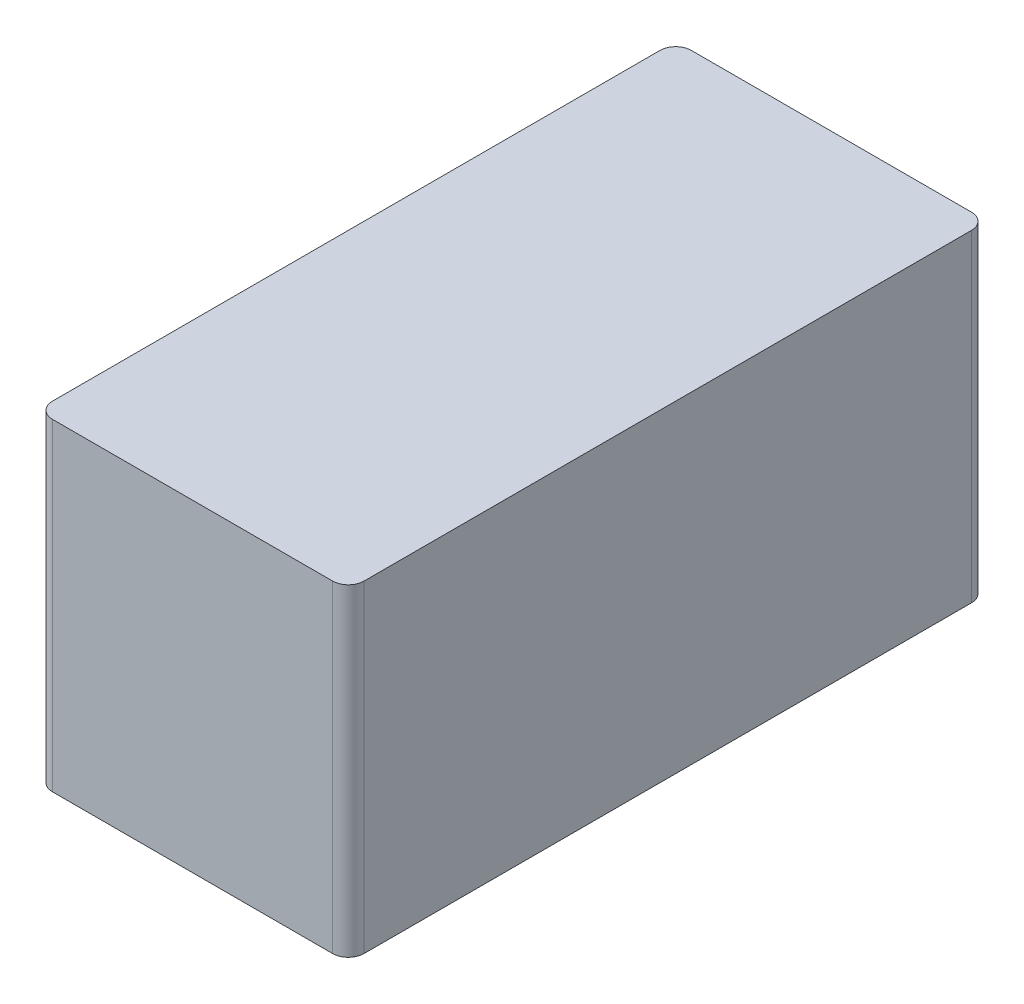
ISO-10303-21;
HEADER;
FILE_DESCRIPTION(('STEP AP214'),'2;1');
FILE_NAME('part.step','',(''),(''),'','','');
FILE_SCHEMA(('AUTOMOTIVE_DESIGN { 1 0 10303 214 1 1 1 1 }'));
ENDSEC;
DATA;
#1=APPLICATION_CONTEXT('core data for automotive mechanical design processes');
#2=APPLICATION_PROTOCOL_DEFINITION('international standard','automotive_design',2000,#1);
#3=PRODUCT_CONTEXT('',#1,'mechanical');
#4=PRODUCT('Part','Part','',(#3));
#5=PRODUCT_RELATED_PRODUCT_CATEGORY('part','',(#4));
#6=PRODUCT_DEFINITION_FORMATION('','',#4);
#7=PRODUCT_DEFINITION_CONTEXT('part definition',#1,'design');
#8=PRODUCT_DEFINITION('design','',#6,#7);
#9=PRODUCT_DEFINITION_SHAPE('','',#8);
#10=(LENGTH_UNIT() NAMED_UNIT(*) SI_UNIT(.MILLI.,.METRE.));
#11=(NAMED_UNIT(*) PLANE_ANGLE_UNIT() SI_UNIT($,.RADIAN.));
#12=(NAMED_UNIT(*) SI_UNIT($,.STERADIAN.) SOLID_ANGLE_UNIT());
#13=UNCERTAINTY_MEASURE_WITH_UNIT(LENGTH_MEASURE(1.E-05),#10,'distance_accuracy_value','');
#14=(GEOMETRIC_REPRESENTATION_CONTEXT(3) GLOBAL_UNCERTAINTY_ASSIGNED_CONTEXT((#13)) GLOBAL_UNIT_ASSIGNED_CONTEXT((#10,
#11,#12)) REPRESENTATION_CONTEXT('',''));
#15=CARTESIAN_POINT('',(0.,0.,0.));
#16=DIRECTION('',(0.,0.,1.));
#17=DIRECTION('',(1.,0.,0.));
#18=AXIS2_PLACEMENT_3D('',#15,#16,#17);
#19=CARTESIAN_POINT('',(9.9,10.25,-20.3));
#20=DIRECTION('',(-1.,0.,0.));
#21=DIRECTION('',(0.,0.,1.));
#22=AXIS2_PLACEMENT_3D('',#19,#20,#21);
#23=PLANE('',#22);
#24=DIRECTION('',(0.,0.,-1.));
#25=VECTOR('',#24,1.);
#26=CARTESIAN_POINT('',(9.9,-10.25,-20.3));
#27=LINE('',#26,#25);
#28=CARTESIAN_POINT('',(9.9,-10.25,19.3));
#29=VERTEX_POINT('',#28);
#30=CARTESIAN_POINT('',(9.9,-10.25,-19.3));
#31=VERTEX_POINT('',#30);
#32=EDGE_CURVE('E127',#29,#31,#27,.T.);
#33=ORIENTED_EDGE('',*,*,#32,.T.);
#34=DIRECTION('',(0.,-1.,0.));
#35=VECTOR('',#34,1.);
#36=CARTESIAN_POINT('',(9.9,10.25,-19.3));
#37=LINE('',#36,#35);
#38=CARTESIAN_POINT('',(9.9,10.25,-19.3));
#39=VERTEX_POINT('',#38);
#40=EDGE_CURVE('E150',#31,#39,#37,.F.);
#41=ORIENTED_EDGE('',*,*,#40,.T.);
#42=DIRECTION('',(0.,0.,-1.));
#43=VECTOR('',#42,1.);
#44=CARTESIAN_POINT('',(9.9,10.25,-20.3));
#45=LINE('',#44,#43);
#46=CARTESIAN_POINT('',(9.9,10.25,19.3));
#47=VERTEX_POINT('',#46);
#48=EDGE_CURVE('E125',#47,#39,#45,.T.);
#49=ORIENTED_EDGE('',*,*,#48,.F.);
#50=DIRECTION('',(0.,-1.,0.));
#51=VECTOR('',#50,1.);
#52=CARTESIAN_POINT('',(9.9,10.25,19.3));
#53=LINE('',#52,#51);
#54=EDGE_CURVE('E147',#47,#29,#53,.T.);
#55=ORIENTED_EDGE('',*,*,#54,.T.);
#56=EDGE_LOOP('',(#33,#41,#49,#55));
#57=FACE_BOUND('',#56,.T.);
#58=ADVANCED_FACE('F32',(#57),#23,.F.);
#59=CARTESIAN_POINT('',(-9.9,10.25,-20.3));
#60=DIRECTION('',(0.,0.,1.));
#61=DIRECTION('',(1.,0.,0.));
#62=AXIS2_PLACEMENT_3D('',#59,#60,#61);
#63=PLANE('',#62);
#64=DIRECTION('',(-1.,0.,0.));
#65=VECTOR('',#64,1.);
#66=CARTESIAN_POINT('',(-9.9,-10.25,-20.3));
#67=LINE('',#66,#65);
#68=CARTESIAN_POINT('',(8.9,-10.25,-20.3));
#69=VERTEX_POINT('',#68);
#70=CARTESIAN_POINT('',(-8.9,-10.25,-20.3));
#71=VERTEX_POINT('',#70);
#72=EDGE_CURVE('E123',#69,#71,#67,.T.);
#73=ORIENTED_EDGE('',*,*,#72,.T.);
#74=DIRECTION('',(0.,-1.,0.));
#75=VECTOR('',#74,1.);
#76=CARTESIAN_POINT('',(-8.9,10.25,-20.3));
#77=LINE('',#76,#75);
#78=CARTESIAN_POINT('',(-8.9,10.25,-20.3));
#79=VERTEX_POINT('',#78);
#80=EDGE_CURVE('E102',#71,#79,#77,.F.);
#81=ORIENTED_EDGE('',*,*,#80,.T.);
#82=DIRECTION('',(-1.,0.,0.));
#83=VECTOR('',#82,1.);
#84=CARTESIAN_POINT('',(-9.9,10.25,-20.3));
#85=LINE('',#84,#83);
#86=CARTESIAN_POINT('',(8.9,10.25,-20.3));
#87=VERTEX_POINT('',#86);
#88=EDGE_CURVE('E166',#87,#79,#85,.T.);
#89=ORIENTED_EDGE('',*,*,#88,.F.);
#90=DIRECTION('',(0.,-1.,0.));
#91=VECTOR('',#90,1.);
#92=CARTESIAN_POINT('',(8.9,10.25,-20.3));
#93=LINE('',#92,#91);
#94=EDGE_CURVE('E107',#87,#69,#93,.T.);
#95=ORIENTED_EDGE('',*,*,#94,.T.);
#96=EDGE_LOOP('',(#73,#81,#89,#95));
#97=FACE_BOUND('',#96,.T.);
#98=ADVANCED_FACE('F183',(#97),#63,.F.);
#99=CARTESIAN_POINT('',(-9.9,10.25,-20.3));
#100=DIRECTION('',(1.,0.,0.));
#101=DIRECTION('',(0.,0.,-1.));
#102=AXIS2_PLACEMENT_3D('',#99,#100,#101);
#103=PLANE('',#102);
#104=DIRECTION('',(0.,0.,1.));
#105=VECTOR('',#104,1.);
#106=CARTESIAN_POINT('',(-9.9,10.25,-20.3));
#107=LINE('',#106,#105);
#108=CARTESIAN_POINT('',(-9.9,10.25,-19.3));
#109=VERTEX_POINT('',#108);
#110=CARTESIAN_POINT('',(-9.9,10.25,19.3));
#111=VERTEX_POINT('',#110);
#112=EDGE_CURVE('E116',#109,#111,#107,.T.);
#113=ORIENTED_EDGE('',*,*,#112,.F.);
#114=DIRECTION('',(0.,-1.,0.));
#115=VECTOR('',#114,1.);
#116=CARTESIAN_POINT('',(-9.9,10.25,-19.3));
#117=LINE('',#116,#115);
#118=CARTESIAN_POINT('',(-9.9,-10.25,-19.3));
#119=VERTEX_POINT('',#118);
#120=EDGE_CURVE('E101',#109,#119,#117,.T.);
#121=ORIENTED_EDGE('',*,*,#120,.T.);
#122=DIRECTION('',(0.,0.,1.));
#123=VECTOR('',#122,1.);
#124=CARTESIAN_POINT('',(-9.9,-10.25,-20.3));
#125=LINE('',#124,#123);
#126=CARTESIAN_POINT('',(-9.9,-10.25,19.3));
#127=VERTEX_POINT('',#126);
#128=EDGE_CURVE('E114',#119,#127,#125,.T.);
#129=ORIENTED_EDGE('',*,*,#128,.T.);
#130=DIRECTION('',(0.,-1.,0.));
#131=VECTOR('',#130,1.);
#132=CARTESIAN_POINT('',(-9.9,10.25,19.3));
#133=LINE('',#132,#131);
#134=EDGE_CURVE('E118',#127,#111,#133,.F.);
#135=ORIENTED_EDGE('',*,*,#134,.T.);
#136=EDGE_LOOP('',(#113,#121,#129,#135));
#137=FACE_BOUND('',#136,.T.);
#138=ADVANCED_FACE('F113',(#137),#103,.F.);
#139=CARTESIAN_POINT('',(-9.9,10.25,20.3));
#140=DIRECTION('',(0.,0.,-1.));
#141=DIRECTION('',(-1.,0.,0.));
#142=AXIS2_PLACEMENT_3D('',#139,#140,#141);
#143=PLANE('',#142);
#144=DIRECTION('',(1.,0.,0.));
#145=VECTOR('',#144,1.);
#146=CARTESIAN_POINT('',(-9.9,-10.25,20.3));
#147=LINE('',#146,#145);
#148=CARTESIAN_POINT('',(-8.9,-10.25,20.3));
#149=VERTEX_POINT('',#148);
#150=CARTESIAN_POINT('',(8.90000000000001,-10.25,20.3));
#151=VERTEX_POINT('',#150);
#152=EDGE_CURVE('E122',#149,#151,#147,.T.);
#153=ORIENTED_EDGE('',*,*,#152,.T.);
#154=DIRECTION('',(0.,-1.,0.));
#155=VECTOR('',#154,1.);
#156=CARTESIAN_POINT('',(8.90000000000001,10.25,20.3));
#157=LINE('',#156,#155);
#158=CARTESIAN_POINT('',(8.90000000000001,10.25,20.3));
#159=VERTEX_POINT('',#158);
#160=EDGE_CURVE('E11',#151,#159,#157,.F.);
#161=ORIENTED_EDGE('',*,*,#160,.T.);
#162=DIRECTION('',(1.,0.,0.));
#163=VECTOR('',#162,1.);
#164=CARTESIAN_POINT('',(-9.9,10.25,20.3));
#165=LINE('',#164,#163);
#166=CARTESIAN_POINT('',(-8.9,10.25,20.3));
#167=VERTEX_POINT('',#166);
#168=EDGE_CURVE('E131',#167,#159,#165,.T.);
#169=ORIENTED_EDGE('',*,*,#168,.F.);
#170=DIRECTION('',(0.,-1.,0.));
#171=VECTOR('',#170,1.);
#172=CARTESIAN_POINT('',(-8.9,10.25,20.3));
#173=LINE('',#172,#171);
#174=EDGE_CURVE('E40',#167,#149,#173,.T.);
#175=ORIENTED_EDGE('',*,*,#174,.T.);
#176=EDGE_LOOP('',(#153,#161,#169,#175));
#177=FACE_BOUND('',#176,.T.);
#178=ADVANCED_FACE('F153',(#177),#143,.F.);
#179=CARTESIAN_POINT('',(0.,10.25,0.));
#180=DIRECTION('',(0.,1.,0.));
#181=DIRECTION('',(0.,0.,1.));
#182=AXIS2_PLACEMENT_3D('',#179,#180,#181);
#183=PLANE('',#182);
#184=ORIENTED_EDGE('',*,*,#88,.T.);
#185=CARTESIAN_POINT('',(-8.9,10.25,-19.3));
#186=DIRECTION('',(0.,1.,0.));
#187=DIRECTION('',(0.,0.,1.));
#188=AXIS2_PLACEMENT_3D('',#185,#186,#187);
#189=CIRCLE('',#188,1.);
#190=EDGE_CURVE('E145',#79,#109,#189,.T.);
#191=ORIENTED_EDGE('',*,*,#190,.T.);
#192=ORIENTED_EDGE('',*,*,#112,.T.);
#193=CARTESIAN_POINT('',(-8.9,10.25,19.3));
#194=DIRECTION('',(0.,1.,0.));
#195=DIRECTION('',(0.,0.,1.));
#196=AXIS2_PLACEMENT_3D('',#193,#194,#195);
#197=CIRCLE('',#196,1.);
#198=EDGE_CURVE('E52',#111,#167,#197,.T.);
#199=ORIENTED_EDGE('',*,*,#198,.T.);
#200=ORIENTED_EDGE('',*,*,#168,.T.);
#201=CARTESIAN_POINT('',(8.90000000000001,10.25,19.3));
#202=DIRECTION('',(0.,1.,0.));
#203=DIRECTION('',(0.,0.,1.));
#204=AXIS2_PLACEMENT_3D('',#201,#202,#203);
#205=CIRCLE('',#204,1.);
#206=EDGE_CURVE('E141',#159,#47,#205,.T.);
#207=ORIENTED_EDGE('',*,*,#206,.T.);
#208=ORIENTED_EDGE('',*,*,#48,.T.);
#209=CARTESIAN_POINT('',(8.9,10.25,-19.3));
#210=DIRECTION('',(0.,1.,0.));
#211=DIRECTION('',(0.,0.,1.));
#212=AXIS2_PLACEMENT_3D('',#209,#210,#211);
#213=CIRCLE('',#212,1.);
#214=EDGE_CURVE('E143',#39,#87,#213,.T.);
#215=ORIENTED_EDGE('',*,*,#214,.T.);
#216=EDGE_LOOP('',(#184,#191,#192,#199,#200,#207,#208,#215));
#217=FACE_BOUND('',#216,.T.);
#218=ADVANCED_FACE('F172',(#217),#183,.T.);
#219=CARTESIAN_POINT('',(0.,-10.25,0.));
#220=DIRECTION('',(0.,1.,0.));
#221=DIRECTION('',(0.,0.,1.));
#222=AXIS2_PLACEMENT_3D('',#219,#220,#221);
#223=PLANE('',#222);
#224=ORIENTED_EDGE('',*,*,#128,.F.);
#225=CARTESIAN_POINT('',(-8.9,-10.25,-19.3));
#226=DIRECTION('',(0.,1.,0.));
#227=DIRECTION('',(0.,0.,1.));
#228=AXIS2_PLACEMENT_3D('',#225,#226,#227);
#229=CIRCLE('',#228,1.);
#230=EDGE_CURVE('E97',#119,#71,#229,.F.);
#231=ORIENTED_EDGE('',*,*,#230,.T.);
#232=ORIENTED_EDGE('',*,*,#72,.F.);
#233=CARTESIAN_POINT('',(8.9,-10.25,-19.3));
#234=DIRECTION('',(0.,1.,0.));
#235=DIRECTION('',(0.,0.,1.));
#236=AXIS2_PLACEMENT_3D('',#233,#234,#235);
#237=CIRCLE('',#236,1.);
#238=EDGE_CURVE('E108',#69,#31,#237,.F.);
#239=ORIENTED_EDGE('',*,*,#238,.T.);
#240=ORIENTED_EDGE('',*,*,#32,.F.);
#241=CARTESIAN_POINT('',(8.90000000000001,-10.25,19.3));
#242=DIRECTION('',(0.,1.,0.));
#243=DIRECTION('',(0.,0.,1.));
#244=AXIS2_PLACEMENT_3D('',#241,#242,#243);
#245=CIRCLE('',#244,1.);
#246=EDGE_CURVE('E134',#29,#151,#245,.F.);
#247=ORIENTED_EDGE('',*,*,#246,.T.);
#248=ORIENTED_EDGE('',*,*,#152,.F.);
#249=CARTESIAN_POINT('',(-8.9,-10.25,19.3));
#250=DIRECTION('',(0.,1.,0.));
#251=DIRECTION('',(0.,0.,1.));
#252=AXIS2_PLACEMENT_3D('',#249,#250,#251);
#253=CIRCLE('',#252,1.);
#254=EDGE_CURVE('E117',#149,#127,#253,.F.);
#255=ORIENTED_EDGE('',*,*,#254,.T.);
#256=EDGE_LOOP('',(#224,#231,#232,#239,#240,#247,#248,#255));
#257=FACE_BOUND('',#256,.T.);
#258=ADVANCED_FACE('F120',(#257),#223,.F.);
#259=CARTESIAN_POINT('',(-8.9,10.25,-19.3));
#260=DIRECTION('',(0.,-1.,0.));
#261=DIRECTION('',(0.,0.,-1.));
#262=AXIS2_PLACEMENT_3D('',#259,#260,#261);
#263=CYLINDRICAL_SURFACE('',#262,1.);
#264=ORIENTED_EDGE('',*,*,#190,.F.);
#265=ORIENTED_EDGE('',*,*,#80,.F.);
#266=ORIENTED_EDGE('',*,*,#230,.F.);
#267=ORIENTED_EDGE('',*,*,#120,.F.);
#268=EDGE_LOOP('',(#264,#265,#266,#267));
#269=FACE_BOUND('',#268,.T.);
#270=ADVANCED_FACE('F100',(#269),#263,.T.);
#271=CARTESIAN_POINT('',(8.9,10.25,-19.3));
#272=DIRECTION('',(0.,-1.,0.));
#273=DIRECTION('',(0.,0.,-1.));
#274=AXIS2_PLACEMENT_3D('',#271,#272,#273);
#275=CYLINDRICAL_SURFACE('',#274,1.);
#276=ORIENTED_EDGE('',*,*,#214,.F.);
#277=ORIENTED_EDGE('',*,*,#40,.F.);
#278=ORIENTED_EDGE('',*,*,#238,.F.);
#279=ORIENTED_EDGE('',*,*,#94,.F.);
#280=EDGE_LOOP('',(#276,#277,#278,#279));
#281=FACE_BOUND('',#280,.T.);
#282=ADVANCED_FACE('F194',(#281),#275,.T.);
#283=CARTESIAN_POINT('',(8.90000000000001,10.25,19.3));
#284=DIRECTION('',(0.,-1.,0.));
#285=DIRECTION('',(0.,0.,-1.));
#286=AXIS2_PLACEMENT_3D('',#283,#284,#285);
#287=CYLINDRICAL_SURFACE('',#286,1.);
#288=ORIENTED_EDGE('',*,*,#206,.F.);
#289=ORIENTED_EDGE('',*,*,#160,.F.);
#290=ORIENTED_EDGE('',*,*,#246,.F.);
#291=ORIENTED_EDGE('',*,*,#54,.F.);
#292=EDGE_LOOP('',(#288,#289,#290,#291));
#293=FACE_BOUND('',#292,.T.);
#294=ADVANCED_FACE('F160',(#293),#287,.T.);
#295=CARTESIAN_POINT('',(-8.9,10.25,19.3));
#296=DIRECTION('',(0.,-1.,0.));
#297=DIRECTION('',(0.,0.,-1.));
#298=AXIS2_PLACEMENT_3D('',#295,#296,#297);
#299=CYLINDRICAL_SURFACE('',#298,1.);
#300=ORIENTED_EDGE('',*,*,#198,.F.);
#301=ORIENTED_EDGE('',*,*,#134,.F.);
#302=ORIENTED_EDGE('',*,*,#254,.F.);
#303=ORIENTED_EDGE('',*,*,#174,.F.);
#304=EDGE_LOOP('',(#300,#301,#302,#303));
#305=FACE_BOUND('',#304,.T.);
#306=ADVANCED_FACE('F34',(#305),#299,.T.);
#307=CLOSED_SHELL('',(#58,#98,#138,#178,#218,#258,#270,#282,#294,#306));
#308=MANIFOLD_SOLID_BREP('B2',#307);
#309=ADVANCED_BREP_SHAPE_REPRESENTATION('',(#18,#308),#14);
#310=SHAPE_DEFINITION_REPRESENTATION(#9,#309);
ENDSEC;
END-ISO-10303-21;
